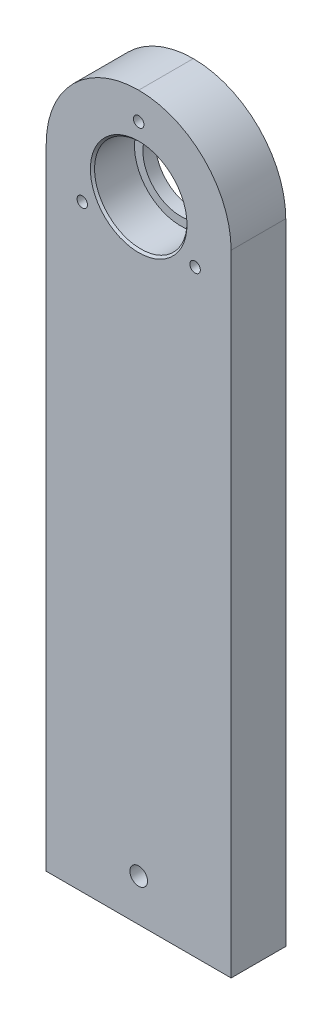
ISO-10303-21;
HEADER;
FILE_DESCRIPTION(('STEP AP214'),'2;1');
FILE_NAME('part.step','',(''),(''),'','','');
FILE_SCHEMA(('AUTOMOTIVE_DESIGN { 1 0 10303 214 1 1 1 1 }'));
ENDSEC;
DATA;
#1=APPLICATION_CONTEXT('core data for automotive mechanical design processes');
#2=APPLICATION_PROTOCOL_DEFINITION('international standard','automotive_design',2000,#1);
#3=PRODUCT_CONTEXT('',#1,'mechanical');
#4=PRODUCT('Part','Part','',(#3));
#5=PRODUCT_RELATED_PRODUCT_CATEGORY('part','',(#4));
#6=PRODUCT_DEFINITION_FORMATION('','',#4);
#7=PRODUCT_DEFINITION_CONTEXT('part definition',#1,'design');
#8=PRODUCT_DEFINITION('design','',#6,#7);
#9=PRODUCT_DEFINITION_SHAPE('','',#8);
#10=(LENGTH_UNIT() NAMED_UNIT(*) SI_UNIT(.MILLI.,.METRE.));
#11=(NAMED_UNIT(*) PLANE_ANGLE_UNIT() SI_UNIT($,.RADIAN.));
#12=(NAMED_UNIT(*) SI_UNIT($,.STERADIAN.) SOLID_ANGLE_UNIT());
#13=UNCERTAINTY_MEASURE_WITH_UNIT(LENGTH_MEASURE(1.E-05),#10,'distance_accuracy_value','');
#14=(GEOMETRIC_REPRESENTATION_CONTEXT(3) GLOBAL_UNCERTAINTY_ASSIGNED_CONTEXT((#13)) GLOBAL_UNIT_ASSIGNED_CONTEXT((#10,
#11,#12)) REPRESENTATION_CONTEXT('',''));
#15=CARTESIAN_POINT('',(0.,0.,0.));
#16=DIRECTION('',(0.,0.,1.));
#17=DIRECTION('',(1.,0.,0.));
#18=AXIS2_PLACEMENT_3D('',#15,#16,#17);
#19=CARTESIAN_POINT('',(-22.,22.,13.));
#20=DIRECTION('',(1.,0.,0.));
#21=DIRECTION('',(0.,1.,0.));
#22=AXIS2_PLACEMENT_3D('',#19,#20,#21);
#23=PLANE('',#22);
#24=DIRECTION('',(0.,-1.,0.));
#25=VECTOR('',#24,1.);
#26=CARTESIAN_POINT('',(-22.,22.,13.));
#27=LINE('',#26,#25);
#28=CARTESIAN_POINT('',(-22.,0.,13.));
#29=VERTEX_POINT('',#28);
#30=CARTESIAN_POINT('',(-22.,-150.,13.));
#31=VERTEX_POINT('',#30);
#32=EDGE_CURVE('E146',#29,#31,#27,.T.);
#33=ORIENTED_EDGE('',*,*,#32,.F.);
#34=DIRECTION('',(0.,0.,-1.));
#35=VECTOR('',#34,1.);
#36=CARTESIAN_POINT('',(-22.,0.,13.));
#37=LINE('',#36,#35);
#38=CARTESIAN_POINT('',(-22.,0.,0.));
#39=VERTEX_POINT('',#38);
#40=EDGE_CURVE('E163',#29,#39,#37,.T.);
#41=ORIENTED_EDGE('',*,*,#40,.T.);
#42=DIRECTION('',(0.,-1.,0.));
#43=VECTOR('',#42,1.);
#44=CARTESIAN_POINT('',(-22.,22.,0.));
#45=LINE('',#44,#43);
#46=CARTESIAN_POINT('',(-22.,-150.,0.));
#47=VERTEX_POINT('',#46);
#48=EDGE_CURVE('E145',#39,#47,#45,.T.);
#49=ORIENTED_EDGE('',*,*,#48,.T.);
#50=DIRECTION('',(0.,0.,-1.));
#51=VECTOR('',#50,1.);
#52=CARTESIAN_POINT('',(-22.,-150.,13.));
#53=LINE('',#52,#51);
#54=EDGE_CURVE('E160',#31,#47,#53,.T.);
#55=ORIENTED_EDGE('',*,*,#54,.F.);
#56=EDGE_LOOP('',(#33,#41,#49,#55));
#57=FACE_BOUND('',#56,.T.);
#58=ADVANCED_FACE('F41',(#57),#23,.F.);
#59=CARTESIAN_POINT('',(-22.,-150.,13.));
#60=DIRECTION('',(0.,1.,0.));
#61=DIRECTION('',(0.,0.,1.));
#62=AXIS2_PLACEMENT_3D('',#59,#60,#61);
#63=PLANE('',#62);
#64=CARTESIAN_POINT('',(-14.,-150.,6.5));
#65=DIRECTION('',(0.,-1.,0.));
#66=DIRECTION('',(0.,0.,-1.));
#67=AXIS2_PLACEMENT_3D('',#64,#65,#66);
#68=CIRCLE('',#67,2.09999999999999);
#69=CARTESIAN_POINT('',(-14.,-150.,4.40000000000001));
#70=VERTEX_POINT('',#69);
#71=EDGE_CURVE('E105',#70,#70,#68,.T.);
#72=ORIENTED_EDGE('',*,*,#71,.F.);
#73=EDGE_LOOP('',(#72));
#74=FACE_BOUND('',#73,.T.);
#75=CARTESIAN_POINT('',(14.,-150.,6.5));
#76=DIRECTION('',(0.,-1.,0.));
#77=DIRECTION('',(0.,0.,-1.));
#78=AXIS2_PLACEMENT_3D('',#75,#76,#77);
#79=CIRCLE('',#78,2.1);
#80=CARTESIAN_POINT('',(14.,-150.,4.4));
#81=VERTEX_POINT('',#80);
#82=EDGE_CURVE('E104',#81,#81,#79,.T.);
#83=ORIENTED_EDGE('',*,*,#82,.F.);
#84=EDGE_LOOP('',(#83));
#85=FACE_BOUND('',#84,.T.);
#86=DIRECTION('',(1.,0.,0.));
#87=VECTOR('',#86,1.);
#88=CARTESIAN_POINT('',(-22.,-150.,0.));
#89=LINE('',#88,#87);
#90=CARTESIAN_POINT('',(22.,-150.,0.));
#91=VERTEX_POINT('',#90);
#92=EDGE_CURVE('E155',#47,#91,#89,.T.);
#93=ORIENTED_EDGE('',*,*,#92,.T.);
#94=DIRECTION('',(0.,0.,-1.));
#95=VECTOR('',#94,1.);
#96=CARTESIAN_POINT('',(22.,-150.,13.));
#97=LINE('',#96,#95);
#98=CARTESIAN_POINT('',(22.,-150.,13.));
#99=VERTEX_POINT('',#98);
#100=EDGE_CURVE('E153',#99,#91,#97,.T.);
#101=ORIENTED_EDGE('',*,*,#100,.F.);
#102=DIRECTION('',(1.,0.,0.));
#103=VECTOR('',#102,1.);
#104=CARTESIAN_POINT('',(-22.,-150.,13.));
#105=LINE('',#104,#103);
#106=EDGE_CURVE('E148',#31,#99,#105,.T.);
#107=ORIENTED_EDGE('',*,*,#106,.F.);
#108=ORIENTED_EDGE('',*,*,#54,.T.);
#109=EDGE_LOOP('',(#93,#101,#107,#108));
#110=FACE_BOUND('',#109,.T.);
#111=ADVANCED_FACE('F191',(#74,#85,#110),#63,.F.);
#112=CARTESIAN_POINT('',(22.,22.,13.));
#113=DIRECTION('',(-1.,0.,0.));
#114=DIRECTION('',(0.,-1.,0.));
#115=AXIS2_PLACEMENT_3D('',#112,#113,#114);
#116=PLANE('',#115);
#117=DIRECTION('',(0.,1.,0.));
#118=VECTOR('',#117,1.);
#119=CARTESIAN_POINT('',(22.,22.,0.));
#120=LINE('',#119,#118);
#121=CARTESIAN_POINT('',(22.,0.,0.));
#122=VERTEX_POINT('',#121);
#123=EDGE_CURVE('E149',#91,#122,#120,.T.);
#124=ORIENTED_EDGE('',*,*,#123,.T.);
#125=DIRECTION('',(0.,0.,-1.));
#126=VECTOR('',#125,1.);
#127=CARTESIAN_POINT('',(22.,0.,13.));
#128=LINE('',#127,#126);
#129=CARTESIAN_POINT('',(22.,0.,13.));
#130=VERTEX_POINT('',#129);
#131=EDGE_CURVE('E64',#122,#130,#128,.F.);
#132=ORIENTED_EDGE('',*,*,#131,.T.);
#133=DIRECTION('',(0.,1.,0.));
#134=VECTOR('',#133,1.);
#135=CARTESIAN_POINT('',(22.,22.,13.));
#136=LINE('',#135,#134);
#137=EDGE_CURVE('E151',#99,#130,#136,.T.);
#138=ORIENTED_EDGE('',*,*,#137,.F.);
#139=ORIENTED_EDGE('',*,*,#100,.T.);
#140=EDGE_LOOP('',(#124,#132,#138,#139));
#141=FACE_BOUND('',#140,.T.);
#142=ADVANCED_FACE('F197',(#141),#116,.F.);
#143=CARTESIAN_POINT('',(-22.,-150.,13.));
#144=DIRECTION('',(0.,0.,1.));
#145=DIRECTION('',(1.,0.,0.));
#146=AXIS2_PLACEMENT_3D('',#143,#144,#145);
#147=PLANE('',#146);
#148=CARTESIAN_POINT('',(0.,0.,13.));
#149=DIRECTION('',(0.,0.,1.));
#150=DIRECTION('',(1.,0.,0.));
#151=AXIS2_PLACEMENT_3D('',#148,#149,#150);
#152=CIRCLE('',#151,11.5);
#153=CARTESIAN_POINT('',(11.5,0.,13.));
#154=VERTEX_POINT('',#153);
#155=EDGE_CURVE('E11',#154,#154,#152,.F.);
#156=ORIENTED_EDGE('',*,*,#155,.T.);
#157=EDGE_LOOP('',(#156));
#158=FACE_BOUND('',#157,.T.);
#159=CARTESIAN_POINT('',(0.,-140.,13.));
#160=DIRECTION('',(0.,0.,1.));
#161=DIRECTION('',(1.,0.,0.));
#162=AXIS2_PLACEMENT_3D('',#159,#160,#161);
#163=CIRCLE('',#162,2.1);
#164=CARTESIAN_POINT('',(2.10000000000002,-140.,13.));
#165=VERTEX_POINT('',#164);
#166=EDGE_CURVE('E404',#165,#165,#163,.T.);
#167=ORIENTED_EDGE('',*,*,#166,.F.);
#168=EDGE_LOOP('',(#167));
#169=FACE_BOUND('',#168,.T.);
#170=CARTESIAN_POINT('',(13.4233937586589,-7.74999999999987,13.));
#171=DIRECTION('',(0.,0.,1.));
#172=DIRECTION('',(1.,0.,0.));
#173=AXIS2_PLACEMENT_3D('',#170,#171,#172);
#174=CIRCLE('',#173,1.24999999999999);
#175=CARTESIAN_POINT('',(14.6733937586589,-7.74999999999987,13.));
#176=VERTEX_POINT('',#175);
#177=EDGE_CURVE('E118',#176,#176,#174,.T.);
#178=ORIENTED_EDGE('',*,*,#177,.F.);
#179=EDGE_LOOP('',(#178));
#180=FACE_BOUND('',#179,.T.);
#181=CARTESIAN_POINT('',(-13.4233937586588,-7.75000000000006,13.));
#182=DIRECTION('',(0.,0.,1.));
#183=DIRECTION('',(1.,0.,0.));
#184=AXIS2_PLACEMENT_3D('',#181,#182,#183);
#185=CIRCLE('',#184,1.24999999999999);
#186=CARTESIAN_POINT('',(-12.1733937586588,-7.75000000000006,13.));
#187=VERTEX_POINT('',#186);
#188=EDGE_CURVE('E124',#187,#187,#185,.T.);
#189=ORIENTED_EDGE('',*,*,#188,.F.);
#190=EDGE_LOOP('',(#189));
#191=FACE_BOUND('',#190,.T.);
#192=CARTESIAN_POINT('',(0.,15.5,13.));
#193=DIRECTION('',(0.,0.,1.));
#194=DIRECTION('',(1.,0.,0.));
#195=AXIS2_PLACEMENT_3D('',#192,#193,#194);
#196=CIRCLE('',#195,1.24999999999999);
#197=CARTESIAN_POINT('',(1.24999999999999,15.5,13.));
#198=VERTEX_POINT('',#197);
#199=EDGE_CURVE('E130',#198,#198,#196,.T.);
#200=ORIENTED_EDGE('',*,*,#199,.F.);
#201=EDGE_LOOP('',(#200));
#202=FACE_BOUND('',#201,.T.);
#203=CARTESIAN_POINT('',(0.,0.,13.));
#204=DIRECTION('',(0.,0.,1.));
#205=DIRECTION('',(1.,0.,0.));
#206=AXIS2_PLACEMENT_3D('',#203,#204,#205);
#207=CIRCLE('',#206,22.);
#208=CARTESIAN_POINT('',(0.,22.,13.));
#209=VERTEX_POINT('',#208);
#210=EDGE_CURVE('E56',#130,#209,#207,.T.);
#211=ORIENTED_EDGE('',*,*,#210,.T.);
#212=CARTESIAN_POINT('',(0.,0.,13.));
#213=DIRECTION('',(0.,0.,1.));
#214=DIRECTION('',(1.,0.,0.));
#215=AXIS2_PLACEMENT_3D('',#212,#213,#214);
#216=CIRCLE('',#215,22.);
#217=EDGE_CURVE('E171',#209,#29,#216,.T.);
#218=ORIENTED_EDGE('',*,*,#217,.T.);
#219=ORIENTED_EDGE('',*,*,#32,.T.);
#220=ORIENTED_EDGE('',*,*,#106,.T.);
#221=ORIENTED_EDGE('',*,*,#137,.T.);
#222=EDGE_LOOP('',(#211,#218,#219,#220,#221));
#223=FACE_BOUND('',#222,.T.);
#224=ADVANCED_FACE('F220',(#158,#169,#180,#191,#202,#223),#147,.T.);
#225=CARTESIAN_POINT('',(-22.,-150.,0.));
#226=DIRECTION('',(0.,0.,1.));
#227=DIRECTION('',(1.,0.,0.));
#228=AXIS2_PLACEMENT_3D('',#225,#226,#227);
#229=PLANE('',#228);
#230=CARTESIAN_POINT('',(0.,-140.,0.));
#231=DIRECTION('',(0.,0.,1.));
#232=DIRECTION('',(1.,0.,0.));
#233=AXIS2_PLACEMENT_3D('',#230,#231,#232);
#234=CIRCLE('',#233,2.1);
#235=CARTESIAN_POINT('',(2.10000000000002,-140.,0.));
#236=VERTEX_POINT('',#235);
#237=EDGE_CURVE('E111',#236,#236,#234,.T.);
#238=ORIENTED_EDGE('',*,*,#237,.T.);
#239=EDGE_LOOP('',(#238));
#240=FACE_BOUND('',#239,.T.);
#241=CARTESIAN_POINT('',(13.4233937586589,-7.74999999999987,0.));
#242=DIRECTION('',(0.,0.,1.));
#243=DIRECTION('',(1.,0.,0.));
#244=AXIS2_PLACEMENT_3D('',#241,#242,#243);
#245=CIRCLE('',#244,1.25);
#246=CARTESIAN_POINT('',(14.6733937586589,-7.74999999999987,0.));
#247=VERTEX_POINT('',#246);
#248=EDGE_CURVE('E121',#247,#247,#245,.T.);
#249=ORIENTED_EDGE('',*,*,#248,.T.);
#250=EDGE_LOOP('',(#249));
#251=FACE_BOUND('',#250,.T.);
#252=CARTESIAN_POINT('',(-13.4233937586588,-7.75000000000006,0.));
#253=DIRECTION('',(0.,0.,1.));
#254=DIRECTION('',(1.,0.,0.));
#255=AXIS2_PLACEMENT_3D('',#252,#253,#254);
#256=CIRCLE('',#255,1.25);
#257=CARTESIAN_POINT('',(-12.1733937586588,-7.75000000000006,0.));
#258=VERTEX_POINT('',#257);
#259=EDGE_CURVE('E127',#258,#258,#256,.T.);
#260=ORIENTED_EDGE('',*,*,#259,.T.);
#261=EDGE_LOOP('',(#260));
#262=FACE_BOUND('',#261,.T.);
#263=CARTESIAN_POINT('',(0.,15.5,0.));
#264=DIRECTION('',(0.,0.,1.));
#265=DIRECTION('',(1.,0.,0.));
#266=AXIS2_PLACEMENT_3D('',#263,#264,#265);
#267=CIRCLE('',#266,1.25);
#268=CARTESIAN_POINT('',(1.24999999999999,15.5,0.));
#269=VERTEX_POINT('',#268);
#270=EDGE_CURVE('E133',#269,#269,#267,.T.);
#271=ORIENTED_EDGE('',*,*,#270,.T.);
#272=EDGE_LOOP('',(#271));
#273=FACE_BOUND('',#272,.T.);
#274=CARTESIAN_POINT('',(0.,0.,0.));
#275=DIRECTION('',(0.,0.,1.));
#276=DIRECTION('',(1.,0.,0.));
#277=AXIS2_PLACEMENT_3D('',#274,#275,#276);
#278=CIRCLE('',#277,9.);
#279=CARTESIAN_POINT('',(9.,0.,0.));
#280=VERTEX_POINT('',#279);
#281=EDGE_CURVE('E137',#280,#280,#278,.T.);
#282=ORIENTED_EDGE('',*,*,#281,.T.);
#283=EDGE_LOOP('',(#282));
#284=FACE_BOUND('',#283,.T.);
#285=ORIENTED_EDGE('',*,*,#48,.F.);
#286=CARTESIAN_POINT('',(0.,0.,0.));
#287=DIRECTION('',(0.,0.,1.));
#288=DIRECTION('',(1.,0.,0.));
#289=AXIS2_PLACEMENT_3D('',#286,#287,#288);
#290=CIRCLE('',#289,22.);
#291=CARTESIAN_POINT('',(0.,22.,0.));
#292=VERTEX_POINT('',#291);
#293=EDGE_CURVE('E168',#39,#292,#290,.F.);
#294=ORIENTED_EDGE('',*,*,#293,.T.);
#295=CARTESIAN_POINT('',(0.,0.,0.));
#296=DIRECTION('',(0.,0.,1.));
#297=DIRECTION('',(1.,0.,0.));
#298=AXIS2_PLACEMENT_3D('',#295,#296,#297);
#299=CIRCLE('',#298,22.);
#300=EDGE_CURVE('E166',#292,#122,#299,.F.);
#301=ORIENTED_EDGE('',*,*,#300,.T.);
#302=ORIENTED_EDGE('',*,*,#123,.F.);
#303=ORIENTED_EDGE('',*,*,#92,.F.);
#304=EDGE_LOOP('',(#285,#294,#301,#302,#303));
#305=FACE_BOUND('',#304,.T.);
#306=ADVANCED_FACE('F229',(#240,#251,#262,#273,#284,#305),#229,.F.);
#307=CARTESIAN_POINT('',(0.,0.,3.));
#308=DIRECTION('',(0.,0.,1.));
#309=DIRECTION('',(1.,0.,0.));
#310=AXIS2_PLACEMENT_3D('',#307,#308,#309);
#311=CYLINDRICAL_SURFACE('',#310,11.);
#312=CARTESIAN_POINT('',(0.,0.,12.5));
#313=DIRECTION('',(0.,0.,1.));
#314=DIRECTION('',(1.,0.,0.));
#315=AXIS2_PLACEMENT_3D('',#312,#313,#314);
#316=CIRCLE('',#315,11.);
#317=CARTESIAN_POINT('',(11.,0.,12.5));
#318=VERTEX_POINT('',#317);
#319=EDGE_CURVE('E49',#318,#318,#316,.T.);
#320=ORIENTED_EDGE('',*,*,#319,.T.);
#321=EDGE_LOOP('',(#320));
#322=FACE_BOUND('',#321,.T.);
#323=CARTESIAN_POINT('',(0.,0.,3.));
#324=DIRECTION('',(0.,0.,1.));
#325=DIRECTION('',(1.,0.,0.));
#326=AXIS2_PLACEMENT_3D('',#323,#324,#325);
#327=CIRCLE('',#326,11.);
#328=CARTESIAN_POINT('',(11.,0.,3.));
#329=VERTEX_POINT('',#328);
#330=EDGE_CURVE('E140',#329,#329,#327,.T.);
#331=ORIENTED_EDGE('',*,*,#330,.F.);
#332=EDGE_LOOP('',(#331));
#333=FACE_BOUND('',#332,.T.);
#334=ADVANCED_FACE('F178',(#322,#333),#311,.F.);
#335=CARTESIAN_POINT('',(0.,0.,3.));
#336=DIRECTION('',(0.,0.,1.));
#337=DIRECTION('',(1.,0.,0.));
#338=AXIS2_PLACEMENT_3D('',#335,#336,#337);
#339=PLANE('',#338);
#340=CARTESIAN_POINT('',(0.,0.,3.));
#341=DIRECTION('',(0.,0.,1.));
#342=DIRECTION('',(1.,0.,0.));
#343=AXIS2_PLACEMENT_3D('',#340,#341,#342);
#344=CIRCLE('',#343,9.);
#345=CARTESIAN_POINT('',(9.,0.,3.));
#346=VERTEX_POINT('',#345);
#347=EDGE_CURVE('E136',#346,#346,#344,.T.);
#348=ORIENTED_EDGE('',*,*,#347,.F.);
#349=EDGE_LOOP('',(#348));
#350=FACE_BOUND('',#349,.T.);
#351=ORIENTED_EDGE('',*,*,#330,.T.);
#352=EDGE_LOOP('',(#351));
#353=FACE_BOUND('',#352,.T.);
#354=ADVANCED_FACE('F237',(#350,#353),#339,.T.);
#355=CARTESIAN_POINT('',(0.,0.,0.));
#356=DIRECTION('',(0.,0.,1.));
#357=DIRECTION('',(1.,0.,0.));
#358=AXIS2_PLACEMENT_3D('',#355,#356,#357);
#359=CYLINDRICAL_SURFACE('',#358,9.);
#360=ORIENTED_EDGE('',*,*,#281,.F.);
#361=EDGE_LOOP('',(#360));
#362=FACE_BOUND('',#361,.T.);
#363=ORIENTED_EDGE('',*,*,#347,.T.);
#364=EDGE_LOOP('',(#363));
#365=FACE_BOUND('',#364,.T.);
#366=ADVANCED_FACE('F333',(#362,#365),#359,.F.);
#367=CARTESIAN_POINT('',(0.,15.5,13.));
#368=DIRECTION('',(0.,0.,1.));
#369=DIRECTION('',(1.,0.,0.));
#370=AXIS2_PLACEMENT_3D('',#367,#368,#369);
#371=CYLINDRICAL_SURFACE('',#370,1.24999999999999);
#372=ORIENTED_EDGE('',*,*,#270,.F.);
#373=EDGE_LOOP('',(#372));
#374=FACE_BOUND('',#373,.T.);
#375=ORIENTED_EDGE('',*,*,#199,.T.);
#376=EDGE_LOOP('',(#375));
#377=FACE_BOUND('',#376,.T.);
#378=ADVANCED_FACE('F324',(#374,#377),#371,.F.);
#379=CARTESIAN_POINT('',(-13.4233937586588,-7.75000000000006,13.));
#380=DIRECTION('',(0.,0.,1.));
#381=DIRECTION('',(1.,0.,0.));
#382=AXIS2_PLACEMENT_3D('',#379,#380,#381);
#383=CYLINDRICAL_SURFACE('',#382,1.24999999999999);
#384=ORIENTED_EDGE('',*,*,#259,.F.);
#385=EDGE_LOOP('',(#384));
#386=FACE_BOUND('',#385,.T.);
#387=ORIENTED_EDGE('',*,*,#188,.T.);
#388=EDGE_LOOP('',(#387));
#389=FACE_BOUND('',#388,.T.);
#390=ADVANCED_FACE('F214',(#386,#389),#383,.F.);
#391=CARTESIAN_POINT('',(13.4233937586589,-7.74999999999987,13.));
#392=DIRECTION('',(0.,0.,1.));
#393=DIRECTION('',(1.,0.,0.));
#394=AXIS2_PLACEMENT_3D('',#391,#392,#393);
#395=CYLINDRICAL_SURFACE('',#394,1.24999999999999);
#396=ORIENTED_EDGE('',*,*,#248,.F.);
#397=EDGE_LOOP('',(#396));
#398=FACE_BOUND('',#397,.T.);
#399=ORIENTED_EDGE('',*,*,#177,.T.);
#400=EDGE_LOOP('',(#399));
#401=FACE_BOUND('',#400,.T.);
#402=ADVANCED_FACE('F209',(#398,#401),#395,.F.);
#403=CARTESIAN_POINT('',(0.,0.,13.));
#404=DIRECTION('',(0.,0.,-1.));
#405=DIRECTION('',(-1.,0.,0.));
#406=AXIS2_PLACEMENT_3D('',#403,#404,#405);
#407=CYLINDRICAL_SURFACE('',#406,22.);
#408=DIRECTION('',(0.,0.,-1.));
#409=VECTOR('',#408,1.);
#410=CARTESIAN_POINT('',(0.,22.,13.));
#411=LINE('',#410,#409);
#412=EDGE_CURVE('E117',#209,#292,#411,.T.);
#413=ORIENTED_EDGE('',*,*,#412,.F.);
#414=ORIENTED_EDGE('',*,*,#210,.F.);
#415=ORIENTED_EDGE('',*,*,#131,.F.);
#416=ORIENTED_EDGE('',*,*,#300,.F.);
#417=EDGE_LOOP('',(#413,#414,#415,#416));
#418=FACE_BOUND('',#417,.T.);
#419=ADVANCED_FACE('F206',(#418),#407,.T.);
#420=CARTESIAN_POINT('',(0.,0.,13.));
#421=DIRECTION('',(0.,0.,-1.));
#422=DIRECTION('',(-1.,0.,0.));
#423=AXIS2_PLACEMENT_3D('',#420,#421,#422);
#424=CYLINDRICAL_SURFACE('',#423,22.);
#425=ORIENTED_EDGE('',*,*,#217,.F.);
#426=ORIENTED_EDGE('',*,*,#412,.T.);
#427=ORIENTED_EDGE('',*,*,#293,.F.);
#428=ORIENTED_EDGE('',*,*,#40,.F.);
#429=EDGE_LOOP('',(#425,#426,#427,#428));
#430=FACE_BOUND('',#429,.T.);
#431=ADVANCED_FACE('F203',(#430),#424,.T.);
#432=CARTESIAN_POINT('',(14.,-136.,6.5));
#433=DIRECTION('',(0.,-1.,0.));
#434=DIRECTION('',(0.,0.,-1.));
#435=AXIS2_PLACEMENT_3D('',#432,#433,#434);
#436=CONICAL_SURFACE('',#435,2.1,1.02974425867666);
#437=CARTESIAN_POINT('',(14.,-134.738192700042,6.5));
#438=VERTEX_POINT('',#437);
#439=VERTEX_LOOP('',#438);
#440=FACE_BOUND('',#439,.T.);
#441=CARTESIAN_POINT('',(14.,-136.,6.5));
#442=DIRECTION('',(0.,-1.,0.));
#443=DIRECTION('',(0.,0.,-1.));
#444=AXIS2_PLACEMENT_3D('',#441,#442,#443);
#445=CIRCLE('',#444,2.1);
#446=CARTESIAN_POINT('',(14.,-136.,4.4));
#447=VERTEX_POINT('',#446);
#448=EDGE_CURVE('E108',#447,#447,#445,.T.);
#449=ORIENTED_EDGE('',*,*,#448,.T.);
#450=EDGE_LOOP('',(#449));
#451=FACE_BOUND('',#450,.T.);
#452=ADVANCED_FACE('F205',(#440,#451),#436,.F.);
#453=CARTESIAN_POINT('',(14.,-150.,6.5));
#454=DIRECTION('',(0.,-1.,0.));
#455=DIRECTION('',(0.,0.,-1.));
#456=AXIS2_PLACEMENT_3D('',#453,#454,#455);
#457=CYLINDRICAL_SURFACE('',#456,2.1);
#458=ORIENTED_EDGE('',*,*,#448,.F.);
#459=EDGE_LOOP('',(#458));
#460=FACE_BOUND('',#459,.T.);
#461=ORIENTED_EDGE('',*,*,#82,.T.);
#462=EDGE_LOOP('',(#461));
#463=FACE_BOUND('',#462,.T.);
#464=ADVANCED_FACE('F98',(#460,#463),#457,.F.);
#465=CARTESIAN_POINT('',(-14.,-136.,6.5));
#466=DIRECTION('',(0.,-1.,0.));
#467=DIRECTION('',(0.,0.,-1.));
#468=AXIS2_PLACEMENT_3D('',#465,#466,#467);
#469=CONICAL_SURFACE('',#468,2.09999999999999,1.02974425867664);
#470=CARTESIAN_POINT('',(-14.,-134.738192700042,6.5));
#471=VERTEX_POINT('',#470);
#472=VERTEX_LOOP('',#471);
#473=FACE_BOUND('',#472,.T.);
#474=CARTESIAN_POINT('',(-14.,-136.,6.5));
#475=DIRECTION('',(0.,-1.,0.));
#476=DIRECTION('',(0.,0.,-1.));
#477=AXIS2_PLACEMENT_3D('',#474,#475,#476);
#478=CIRCLE('',#477,2.09999999999999);
#479=CARTESIAN_POINT('',(-14.,-136.,4.40000000000001));
#480=VERTEX_POINT('',#479);
#481=EDGE_CURVE('E102',#480,#480,#478,.T.);
#482=ORIENTED_EDGE('',*,*,#481,.T.);
#483=EDGE_LOOP('',(#482));
#484=FACE_BOUND('',#483,.T.);
#485=ADVANCED_FACE('F94',(#473,#484),#469,.F.);
#486=CARTESIAN_POINT('',(-14.,-150.,6.5));
#487=DIRECTION('',(0.,-1.,0.));
#488=DIRECTION('',(0.,0.,-1.));
#489=AXIS2_PLACEMENT_3D('',#486,#487,#488);
#490=CYLINDRICAL_SURFACE('',#489,2.09999999999999);
#491=ORIENTED_EDGE('',*,*,#481,.F.);
#492=EDGE_LOOP('',(#491));
#493=FACE_BOUND('',#492,.T.);
#494=ORIENTED_EDGE('',*,*,#71,.T.);
#495=EDGE_LOOP('',(#494));
#496=FACE_BOUND('',#495,.T.);
#497=ADVANCED_FACE('F97',(#493,#496),#490,.F.);
#498=CARTESIAN_POINT('',(0.,-140.,13.));
#499=DIRECTION('',(0.,0.,1.));
#500=DIRECTION('',(1.,0.,0.));
#501=AXIS2_PLACEMENT_3D('',#498,#499,#500);
#502=CYLINDRICAL_SURFACE('',#501,2.1);
#503=ORIENTED_EDGE('',*,*,#237,.F.);
#504=EDGE_LOOP('',(#503));
#505=FACE_BOUND('',#504,.T.);
#506=ORIENTED_EDGE('',*,*,#166,.T.);
#507=EDGE_LOOP('',(#506));
#508=FACE_BOUND('',#507,.T.);
#509=ADVANCED_FACE('F182',(#505,#508),#502,.F.);
#510=CARTESIAN_POINT('',(0.,0.,12.5));
#511=DIRECTION('',(0.,0.,1.));
#512=DIRECTION('',(1.,0.,0.));
#513=AXIS2_PLACEMENT_3D('',#510,#511,#512);
#514=CONICAL_SURFACE('',#513,11.,0.78539816339744);
#515=ORIENTED_EDGE('',*,*,#155,.F.);
#516=EDGE_LOOP('',(#515));
#517=FACE_BOUND('',#516,.T.);
#518=ORIENTED_EDGE('',*,*,#319,.F.);
#519=EDGE_LOOP('',(#518));
#520=FACE_BOUND('',#519,.T.);
#521=ADVANCED_FACE('F43',(#517,#520),#514,.F.);
#522=CLOSED_SHELL('',(#58,#111,#142,#224,#306,#334,#354,#366,#378,#390,#402,#419,#431,#452,#464,
#485,#497,#509,#521));
#523=MANIFOLD_SOLID_BREP('B2',#522);
#524=ADVANCED_BREP_SHAPE_REPRESENTATION('',(#18,#523),#14);
#525=SHAPE_DEFINITION_REPRESENTATION(#9,#524);
ENDSEC;
END-ISO-10303-21;
